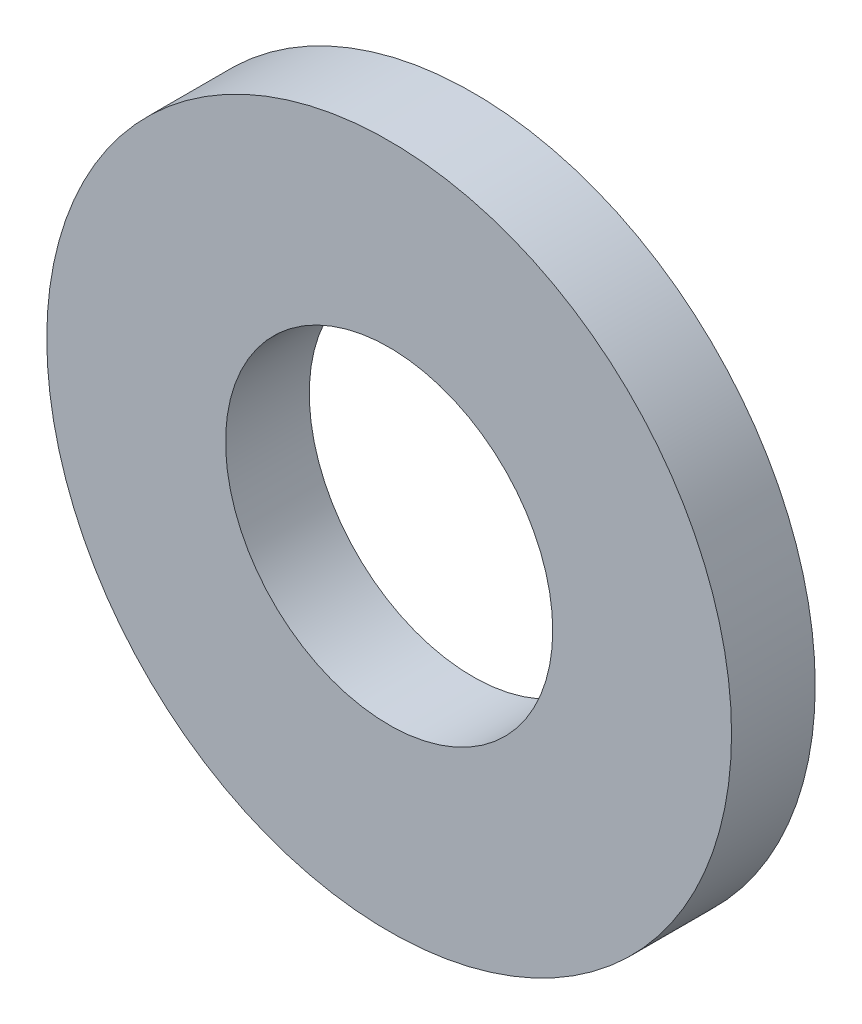
ISO-10303-21;
HEADER;
FILE_DESCRIPTION(('STEP AP214'),'2;1');
FILE_NAME('part.step','',(''),(''),'','','');
FILE_SCHEMA(('AUTOMOTIVE_DESIGN { 1 0 10303 214 1 1 1 1 }'));
ENDSEC;
DATA;
#1=APPLICATION_CONTEXT('core data for automotive mechanical design processes');
#2=APPLICATION_PROTOCOL_DEFINITION('international standard','automotive_design',2000,#1);
#3=PRODUCT_CONTEXT('',#1,'mechanical');
#4=PRODUCT('Part','Part','',(#3));
#5=PRODUCT_RELATED_PRODUCT_CATEGORY('part','',(#4));
#6=PRODUCT_DEFINITION_FORMATION('','',#4);
#7=PRODUCT_DEFINITION_CONTEXT('part definition',#1,'design');
#8=PRODUCT_DEFINITION('design','',#6,#7);
#9=PRODUCT_DEFINITION_SHAPE('','',#8);
#10=(LENGTH_UNIT() NAMED_UNIT(*) SI_UNIT(.MILLI.,.METRE.));
#11=(NAMED_UNIT(*) PLANE_ANGLE_UNIT() SI_UNIT($,.RADIAN.));
#12=(NAMED_UNIT(*) SI_UNIT($,.STERADIAN.) SOLID_ANGLE_UNIT());
#13=UNCERTAINTY_MEASURE_WITH_UNIT(LENGTH_MEASURE(1.E-05),#10,'distance_accuracy_value','');
#14=(GEOMETRIC_REPRESENTATION_CONTEXT(3) GLOBAL_UNCERTAINTY_ASSIGNED_CONTEXT((#13)) GLOBAL_UNIT_ASSIGNED_CONTEXT((#10,
#11,#12)) REPRESENTATION_CONTEXT('',''));
#15=CARTESIAN_POINT('',(0.,0.,0.));
#16=DIRECTION('',(0.,0.,1.));
#17=DIRECTION('',(1.,0.,0.));
#18=AXIS2_PLACEMENT_3D('',#15,#16,#17);
#19=CARTESIAN_POINT('',(0.,0.,1.1));
#20=DIRECTION('',(0.,0.,1.));
#21=DIRECTION('',(1.,0.,0.));
#22=AXIS2_PLACEMENT_3D('',#19,#20,#21);
#23=PLANE('',#22);
#24=CARTESIAN_POINT('',(0.,0.,1.1));
#25=DIRECTION('',(0.,0.,1.));
#26=DIRECTION('',(1.,0.,0.));
#27=AXIS2_PLACEMENT_3D('',#24,#25,#26);
#28=CIRCLE('',#27,4.5);
#29=CARTESIAN_POINT('',(4.5,0.,1.1));
#30=VERTEX_POINT('',#29);
#31=EDGE_CURVE('E12',#30,#30,#28,.T.);
#32=ORIENTED_EDGE('',*,*,#31,.T.);
#33=EDGE_LOOP('',(#32));
#34=FACE_BOUND('',#33,.T.);
#35=CARTESIAN_POINT('',(0.,0.,1.1));
#36=DIRECTION('',(0.,0.,1.));
#37=DIRECTION('',(1.,0.,0.));
#38=AXIS2_PLACEMENT_3D('',#35,#36,#37);
#39=CIRCLE('',#38,2.15);
#40=CARTESIAN_POINT('',(2.15,0.,1.1));
#41=VERTEX_POINT('',#40);
#42=EDGE_CURVE('E55',#41,#41,#39,.T.);
#43=ORIENTED_EDGE('',*,*,#42,.F.);
#44=EDGE_LOOP('',(#43));
#45=FACE_BOUND('',#44,.T.);
#46=ADVANCED_FACE('F44',(#34,#45),#23,.T.);
#47=CARTESIAN_POINT('',(0.,0.,0.));
#48=DIRECTION('',(0.,0.,1.));
#49=DIRECTION('',(1.,0.,0.));
#50=AXIS2_PLACEMENT_3D('',#47,#48,#49);
#51=PLANE('',#50);
#52=CARTESIAN_POINT('',(0.,0.,0.));
#53=DIRECTION('',(0.,0.,1.));
#54=DIRECTION('',(1.,0.,0.));
#55=AXIS2_PLACEMENT_3D('',#52,#53,#54);
#56=CIRCLE('',#55,4.5);
#57=CARTESIAN_POINT('',(4.5,0.,0.));
#58=VERTEX_POINT('',#57);
#59=EDGE_CURVE('E48',#58,#58,#56,.T.);
#60=ORIENTED_EDGE('',*,*,#59,.F.);
#61=EDGE_LOOP('',(#60));
#62=FACE_BOUND('',#61,.T.);
#63=CARTESIAN_POINT('',(0.,0.,0.));
#64=DIRECTION('',(0.,0.,1.));
#65=DIRECTION('',(1.,0.,0.));
#66=AXIS2_PLACEMENT_3D('',#63,#64,#65);
#67=CIRCLE('',#66,2.15);
#68=CARTESIAN_POINT('',(2.15,0.,0.));
#69=VERTEX_POINT('',#68);
#70=EDGE_CURVE('E57',#69,#69,#67,.T.);
#71=ORIENTED_EDGE('',*,*,#70,.T.);
#72=EDGE_LOOP('',(#71));
#73=FACE_BOUND('',#72,.T.);
#74=ADVANCED_FACE('F67',(#62,#73),#51,.F.);
#75=CARTESIAN_POINT('',(0.,0.,1.1));
#76=DIRECTION('',(0.,0.,-1.));
#77=DIRECTION('',(-1.,0.,0.));
#78=AXIS2_PLACEMENT_3D('',#75,#76,#77);
#79=CYLINDRICAL_SURFACE('',#78,4.5);
#80=ORIENTED_EDGE('',*,*,#31,.F.);
#81=EDGE_LOOP('',(#80));
#82=FACE_BOUND('',#81,.T.);
#83=ORIENTED_EDGE('',*,*,#59,.T.);
#84=EDGE_LOOP('',(#83));
#85=FACE_BOUND('',#84,.T.);
#86=ADVANCED_FACE('F46',(#82,#85),#79,.T.);
#87=CARTESIAN_POINT('',(0.,0.,1.1));
#88=DIRECTION('',(0.,0.,-1.));
#89=DIRECTION('',(-1.,0.,0.));
#90=AXIS2_PLACEMENT_3D('',#87,#88,#89);
#91=CYLINDRICAL_SURFACE('',#90,2.15);
#92=ORIENTED_EDGE('',*,*,#42,.T.);
#93=EDGE_LOOP('',(#92));
#94=FACE_BOUND('',#93,.T.);
#95=ORIENTED_EDGE('',*,*,#70,.F.);
#96=EDGE_LOOP('',(#95));
#97=FACE_BOUND('',#96,.T.);
#98=ADVANCED_FACE('F63',(#94,#97),#91,.F.);
#99=CLOSED_SHELL('',(#46,#74,#86,#98));
#100=MANIFOLD_SOLID_BREP('B2',#99);
#101=ADVANCED_BREP_SHAPE_REPRESENTATION('',(#18,#100),#14);
#102=SHAPE_DEFINITION_REPRESENTATION(#9,#101);
ENDSEC;
END-ISO-10303-21;
